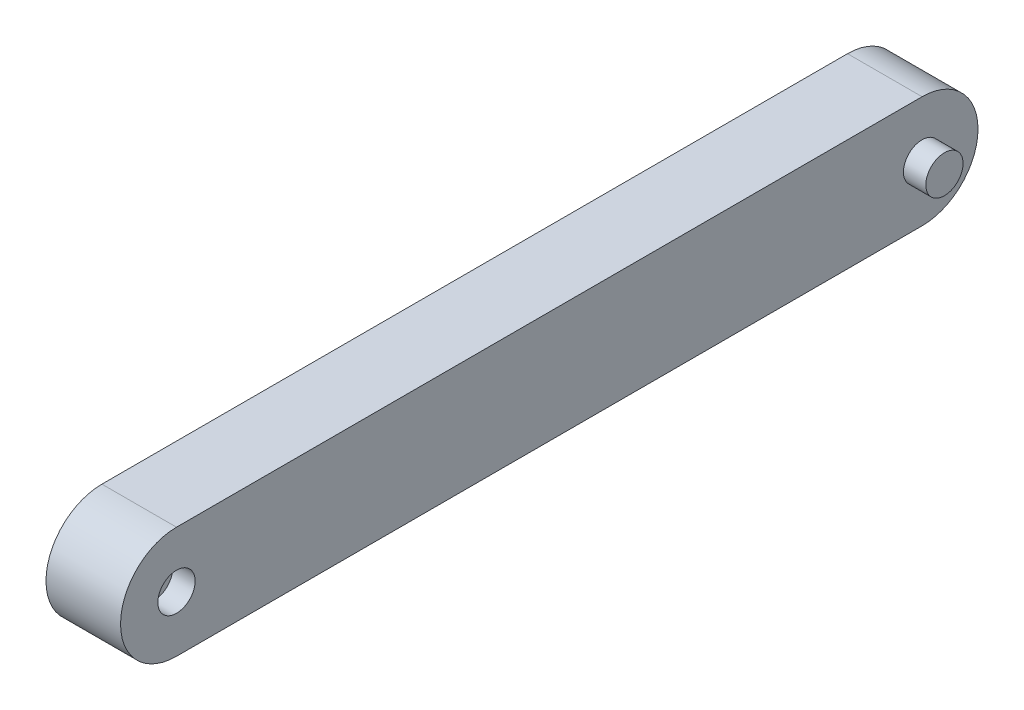
ISO-10303-21;
HEADER;
FILE_DESCRIPTION(('STEP AP214'),'2;1');
FILE_NAME('part.step','',(''),(''),'','','');
FILE_SCHEMA(('AUTOMOTIVE_DESIGN { 1 0 10303 214 1 1 1 1 }'));
ENDSEC;
DATA;
#1=APPLICATION_CONTEXT('core data for automotive mechanical design processes');
#2=APPLICATION_PROTOCOL_DEFINITION('international standard','automotive_design',2000,#1);
#3=PRODUCT_CONTEXT('',#1,'mechanical');
#4=PRODUCT('Part','Part','',(#3));
#5=PRODUCT_RELATED_PRODUCT_CATEGORY('part','',(#4));
#6=PRODUCT_DEFINITION_FORMATION('','',#4);
#7=PRODUCT_DEFINITION_CONTEXT('part definition',#1,'design');
#8=PRODUCT_DEFINITION('design','',#6,#7);
#9=PRODUCT_DEFINITION_SHAPE('','',#8);
#10=(LENGTH_UNIT() NAMED_UNIT(*) SI_UNIT(.MILLI.,.METRE.));
#11=(NAMED_UNIT(*) PLANE_ANGLE_UNIT() SI_UNIT($,.RADIAN.));
#12=(NAMED_UNIT(*) SI_UNIT($,.STERADIAN.) SOLID_ANGLE_UNIT());
#13=UNCERTAINTY_MEASURE_WITH_UNIT(LENGTH_MEASURE(1.E-05),#10,'distance_accuracy_value','');
#14=(GEOMETRIC_REPRESENTATION_CONTEXT(3) GLOBAL_UNCERTAINTY_ASSIGNED_CONTEXT((#13)) GLOBAL_UNIT_ASSIGNED_CONTEXT((#10,
#11,#12)) REPRESENTATION_CONTEXT('',''));
#15=CARTESIAN_POINT('',(0.,0.,0.));
#16=DIRECTION('',(0.,0.,1.));
#17=DIRECTION('',(1.,0.,0.));
#18=AXIS2_PLACEMENT_3D('',#15,#16,#17);
#19=CARTESIAN_POINT('',(20.,-1.92908528670217E-13,100.));
#20=DIRECTION('',(-1.,0.,0.));
#21=DIRECTION('',(0.,0.,1.));
#22=AXIS2_PLACEMENT_3D('',#19,#20,#21);
#23=CYLINDRICAL_SURFACE('',#22,15.);
#24=CARTESIAN_POINT('',(0.,-1.92908528670217E-13,100.));
#25=DIRECTION('',(1.,0.,0.));
#26=DIRECTION('',(0.,0.,-1.));
#27=AXIS2_PLACEMENT_3D('',#24,#25,#26);
#28=CIRCLE('',#27,15.);
#29=CARTESIAN_POINT('',(0.,15.,100.));
#30=VERTEX_POINT('',#29);
#31=CARTESIAN_POINT('',(0.,-15.,100.));
#32=VERTEX_POINT('',#31);
#33=EDGE_CURVE('E111',#30,#32,#28,.T.);
#34=ORIENTED_EDGE('',*,*,#33,.T.);
#35=DIRECTION('',(-1.,0.,0.));
#36=VECTOR('',#35,1.);
#37=CARTESIAN_POINT('',(20.,-15.,100.));
#38=LINE('',#37,#36);
#39=CARTESIAN_POINT('',(20.,-15.,100.));
#40=VERTEX_POINT('',#39);
#41=EDGE_CURVE('E11',#40,#32,#38,.T.);
#42=ORIENTED_EDGE('',*,*,#41,.F.);
#43=CARTESIAN_POINT('',(20.,-1.92908528670217E-13,100.));
#44=DIRECTION('',(1.,0.,0.));
#45=DIRECTION('',(0.,0.,-1.));
#46=AXIS2_PLACEMENT_3D('',#43,#44,#45);
#47=CIRCLE('',#46,15.);
#48=CARTESIAN_POINT('',(20.,15.,100.));
#49=VERTEX_POINT('',#48);
#50=EDGE_CURVE('E95',#49,#40,#47,.T.);
#51=ORIENTED_EDGE('',*,*,#50,.F.);
#52=DIRECTION('',(-1.,0.,0.));
#53=VECTOR('',#52,1.);
#54=CARTESIAN_POINT('',(20.,15.,100.));
#55=LINE('',#54,#53);
#56=EDGE_CURVE('E107',#49,#30,#55,.T.);
#57=ORIENTED_EDGE('',*,*,#56,.T.);
#58=EDGE_LOOP('',(#34,#42,#51,#57));
#59=FACE_BOUND('',#58,.T.);
#60=ADVANCED_FACE('F43',(#59),#23,.T.);
#61=CARTESIAN_POINT('',(20.,-15.,-100.));
#62=DIRECTION('',(0.,1.,0.));
#63=DIRECTION('',(0.,0.,1.));
#64=AXIS2_PLACEMENT_3D('',#61,#62,#63);
#65=PLANE('',#64);
#66=DIRECTION('',(0.,0.,-1.));
#67=VECTOR('',#66,1.);
#68=CARTESIAN_POINT('',(0.,-15.,-100.));
#69=LINE('',#68,#67);
#70=CARTESIAN_POINT('',(0.,-15.,-100.));
#71=VERTEX_POINT('',#70);
#72=EDGE_CURVE('E100',#32,#71,#69,.T.);
#73=ORIENTED_EDGE('',*,*,#72,.T.);
#74=DIRECTION('',(-1.,0.,0.));
#75=VECTOR('',#74,1.);
#76=CARTESIAN_POINT('',(20.,-15.,-100.));
#77=LINE('',#76,#75);
#78=CARTESIAN_POINT('',(20.,-15.,-100.));
#79=VERTEX_POINT('',#78);
#80=EDGE_CURVE('E52',#79,#71,#77,.T.);
#81=ORIENTED_EDGE('',*,*,#80,.F.);
#82=DIRECTION('',(0.,0.,-1.));
#83=VECTOR('',#82,1.);
#84=CARTESIAN_POINT('',(20.,-15.,-100.));
#85=LINE('',#84,#83);
#86=EDGE_CURVE('E90',#40,#79,#85,.T.);
#87=ORIENTED_EDGE('',*,*,#86,.F.);
#88=ORIENTED_EDGE('',*,*,#41,.T.);
#89=EDGE_LOOP('',(#73,#81,#87,#88));
#90=FACE_BOUND('',#89,.T.);
#91=ADVANCED_FACE('F99',(#90),#65,.F.);
#92=CARTESIAN_POINT('',(20.,0.,-100.000000049961));
#93=DIRECTION('',(-1.,0.,0.));
#94=DIRECTION('',(0.,0.,1.));
#95=AXIS2_PLACEMENT_3D('',#92,#93,#94);
#96=CYLINDRICAL_SURFACE('',#95,15.);
#97=CARTESIAN_POINT('',(0.,0.,-100.000000049961));
#98=DIRECTION('',(1.,0.,0.));
#99=DIRECTION('',(0.,0.,1.));
#100=AXIS2_PLACEMENT_3D('',#97,#98,#99);
#101=CIRCLE('',#100,15.);
#102=CARTESIAN_POINT('',(0.,15.,-100.000000099922));
#103=VERTEX_POINT('',#102);
#104=EDGE_CURVE('E77',#71,#103,#101,.T.);
#105=ORIENTED_EDGE('',*,*,#104,.T.);
#106=DIRECTION('',(-1.,0.,0.));
#107=VECTOR('',#106,1.);
#108=CARTESIAN_POINT('',(20.,15.,-100.000000099922));
#109=LINE('',#108,#107);
#110=CARTESIAN_POINT('',(20.,15.,-100.000000099922));
#111=VERTEX_POINT('',#110);
#112=EDGE_CURVE('E102',#111,#103,#109,.T.);
#113=ORIENTED_EDGE('',*,*,#112,.F.);
#114=CARTESIAN_POINT('',(20.,0.,-100.000000049961));
#115=DIRECTION('',(1.,0.,0.));
#116=DIRECTION('',(0.,0.,1.));
#117=AXIS2_PLACEMENT_3D('',#114,#115,#116);
#118=CIRCLE('',#117,15.);
#119=EDGE_CURVE('E93',#79,#111,#118,.T.);
#120=ORIENTED_EDGE('',*,*,#119,.F.);
#121=ORIENTED_EDGE('',*,*,#80,.T.);
#122=EDGE_LOOP('',(#105,#113,#120,#121));
#123=FACE_BOUND('',#122,.T.);
#124=ADVANCED_FACE('F103',(#123),#96,.T.);
#125=CARTESIAN_POINT('',(20.,15.,-100.000000099922));
#126=DIRECTION('',(0.,-1.,0.));
#127=DIRECTION('',(0.,0.,-1.));
#128=AXIS2_PLACEMENT_3D('',#125,#126,#127);
#129=PLANE('',#128);
#130=DIRECTION('',(0.,0.,1.));
#131=VECTOR('',#130,1.);
#132=CARTESIAN_POINT('',(0.,15.,-100.000000099922));
#133=LINE('',#132,#131);
#134=EDGE_CURVE('E83',#103,#30,#133,.T.);
#135=ORIENTED_EDGE('',*,*,#134,.T.);
#136=ORIENTED_EDGE('',*,*,#56,.F.);
#137=DIRECTION('',(0.,0.,1.));
#138=VECTOR('',#137,1.);
#139=CARTESIAN_POINT('',(20.,15.,-100.000000099922));
#140=LINE('',#139,#138);
#141=EDGE_CURVE('E60',#111,#49,#140,.T.);
#142=ORIENTED_EDGE('',*,*,#141,.F.);
#143=ORIENTED_EDGE('',*,*,#112,.T.);
#144=EDGE_LOOP('',(#135,#136,#142,#143));
#145=FACE_BOUND('',#144,.T.);
#146=ADVANCED_FACE('F125',(#145),#129,.F.);
#147=CARTESIAN_POINT('',(20.,-1.92908528670217E-13,100.));
#148=DIRECTION('',(1.,0.,0.));
#149=DIRECTION('',(0.,0.,-1.));
#150=AXIS2_PLACEMENT_3D('',#147,#148,#149);
#151=PLANE('',#150);
#152=CARTESIAN_POINT('',(20.,-1.92908528670217E-13,100.));
#153=DIRECTION('',(1.,0.,0.));
#154=DIRECTION('',(0.,0.,-1.));
#155=AXIS2_PLACEMENT_3D('',#152,#153,#154);
#156=CIRCLE('',#155,5.);
#157=CARTESIAN_POINT('',(20.,-1.92908528670217E-13,95.));
#158=VERTEX_POINT('',#157);
#159=EDGE_CURVE('E140',#158,#158,#156,.T.);
#160=ORIENTED_EDGE('',*,*,#159,.F.);
#161=EDGE_LOOP('',(#160));
#162=FACE_BOUND('',#161,.T.);
#163=CARTESIAN_POINT('',(20.,0.,-100.000000049961));
#164=DIRECTION('',(1.,0.,0.));
#165=DIRECTION('',(0.,0.,-1.));
#166=AXIS2_PLACEMENT_3D('',#163,#164,#165);
#167=CIRCLE('',#166,5.);
#168=CARTESIAN_POINT('',(20.,0.,-105.000000049961));
#169=VERTEX_POINT('',#168);
#170=EDGE_CURVE('E132',#169,#169,#167,.T.);
#171=ORIENTED_EDGE('',*,*,#170,.F.);
#172=EDGE_LOOP('',(#171));
#173=FACE_BOUND('',#172,.T.);
#174=ORIENTED_EDGE('',*,*,#50,.T.);
#175=ORIENTED_EDGE('',*,*,#86,.T.);
#176=ORIENTED_EDGE('',*,*,#119,.T.);
#177=ORIENTED_EDGE('',*,*,#141,.T.);
#178=EDGE_LOOP('',(#174,#175,#176,#177));
#179=FACE_BOUND('',#178,.T.);
#180=ADVANCED_FACE('F91',(#162,#173,#179),#151,.T.);
#181=CARTESIAN_POINT('',(0.,-1.92908528670217E-13,100.));
#182=DIRECTION('',(1.,0.,0.));
#183=DIRECTION('',(0.,0.,-1.));
#184=AXIS2_PLACEMENT_3D('',#181,#182,#183);
#185=PLANE('',#184);
#186=CARTESIAN_POINT('',(0.,-1.92908528670217E-13,100.));
#187=DIRECTION('',(1.,0.,0.));
#188=DIRECTION('',(0.,0.,-1.));
#189=AXIS2_PLACEMENT_3D('',#186,#187,#188);
#190=CIRCLE('',#189,5.);
#191=CARTESIAN_POINT('',(0.,-1.92908528670217E-13,95.));
#192=VERTEX_POINT('',#191);
#193=EDGE_CURVE('E156',#192,#192,#190,.T.);
#194=ORIENTED_EDGE('',*,*,#193,.T.);
#195=EDGE_LOOP('',(#194));
#196=FACE_BOUND('',#195,.T.);
#197=CARTESIAN_POINT('',(0.,0.,-100.000000049961));
#198=DIRECTION('',(1.,0.,0.));
#199=DIRECTION('',(0.,0.,-1.));
#200=AXIS2_PLACEMENT_3D('',#197,#198,#199);
#201=CIRCLE('',#200,5.);
#202=CARTESIAN_POINT('',(0.,0.,-105.000000049961));
#203=VERTEX_POINT('',#202);
#204=EDGE_CURVE('E148',#203,#203,#201,.T.);
#205=ORIENTED_EDGE('',*,*,#204,.T.);
#206=EDGE_LOOP('',(#205));
#207=FACE_BOUND('',#206,.T.);
#208=ORIENTED_EDGE('',*,*,#33,.F.);
#209=ORIENTED_EDGE('',*,*,#134,.F.);
#210=ORIENTED_EDGE('',*,*,#104,.F.);
#211=ORIENTED_EDGE('',*,*,#72,.F.);
#212=EDGE_LOOP('',(#208,#209,#210,#211));
#213=FACE_BOUND('',#212,.T.);
#214=ADVANCED_FACE('F128',(#196,#207,#213),#185,.F.);
#215=CARTESIAN_POINT('',(26.,0.,-100.000000049961));
#216=DIRECTION('',(-1.,0.,0.));
#217=DIRECTION('',(0.,0.,1.));
#218=AXIS2_PLACEMENT_3D('',#215,#216,#217);
#219=CYLINDRICAL_SURFACE('',#218,5.);
#220=CARTESIAN_POINT('',(26.,0.,-100.000000049961));
#221=DIRECTION('',(1.,0.,0.));
#222=DIRECTION('',(0.,0.,-1.));
#223=AXIS2_PLACEMENT_3D('',#220,#221,#222);
#224=CIRCLE('',#223,5.);
#225=CARTESIAN_POINT('',(26.,0.,-105.000000049961));
#226=VERTEX_POINT('',#225);
#227=EDGE_CURVE('E115',#226,#226,#224,.T.);
#228=ORIENTED_EDGE('',*,*,#227,.F.);
#229=EDGE_LOOP('',(#228));
#230=FACE_BOUND('',#229,.T.);
#231=ORIENTED_EDGE('',*,*,#170,.T.);
#232=EDGE_LOOP('',(#231));
#233=FACE_BOUND('',#232,.T.);
#234=ADVANCED_FACE('F188',(#230,#233),#219,.T.);
#235=CARTESIAN_POINT('',(26.,0.,-100.000000049961));
#236=DIRECTION('',(1.,0.,0.));
#237=DIRECTION('',(0.,0.,-1.));
#238=AXIS2_PLACEMENT_3D('',#235,#236,#237);
#239=PLANE('',#238);
#240=ORIENTED_EDGE('',*,*,#227,.T.);
#241=EDGE_LOOP('',(#240));
#242=FACE_BOUND('',#241,.T.);
#243=ADVANCED_FACE('F195',(#242),#239,.T.);
#244=CARTESIAN_POINT('',(14.,-1.92908528670217E-13,100.));
#245=DIRECTION('',(1.,0.,0.));
#246=DIRECTION('',(0.,0.,-1.));
#247=AXIS2_PLACEMENT_3D('',#244,#245,#246);
#248=CYLINDRICAL_SURFACE('',#247,5.);
#249=CARTESIAN_POINT('',(14.,-1.92908528670217E-13,100.));
#250=DIRECTION('',(1.,0.,0.));
#251=DIRECTION('',(0.,0.,-1.));
#252=AXIS2_PLACEMENT_3D('',#249,#250,#251);
#253=CIRCLE('',#252,5.);
#254=CARTESIAN_POINT('',(14.,-1.92908528670217E-13,95.));
#255=VERTEX_POINT('',#254);
#256=EDGE_CURVE('E136',#255,#255,#253,.T.);
#257=ORIENTED_EDGE('',*,*,#256,.F.);
#258=EDGE_LOOP('',(#257));
#259=FACE_BOUND('',#258,.T.);
#260=ORIENTED_EDGE('',*,*,#159,.T.);
#261=EDGE_LOOP('',(#260));
#262=FACE_BOUND('',#261,.T.);
#263=ADVANCED_FACE('F199',(#259,#262),#248,.F.);
#264=CARTESIAN_POINT('',(14.,-1.92908528670217E-13,100.));
#265=DIRECTION('',(1.,0.,0.));
#266=DIRECTION('',(0.,0.,-1.));
#267=AXIS2_PLACEMENT_3D('',#264,#265,#266);
#268=PLANE('',#267);
#269=ORIENTED_EDGE('',*,*,#256,.T.);
#270=EDGE_LOOP('',(#269));
#271=FACE_BOUND('',#270,.T.);
#272=ADVANCED_FACE('F203',(#271),#268,.T.);
#273=CARTESIAN_POINT('',(-6.,0.,-100.000000049961));
#274=DIRECTION('',(1.,0.,0.));
#275=DIRECTION('',(0.,0.,-1.));
#276=AXIS2_PLACEMENT_3D('',#273,#274,#275);
#277=CYLINDRICAL_SURFACE('',#276,5.);
#278=CARTESIAN_POINT('',(-6.,0.,-100.000000049961));
#279=DIRECTION('',(1.,0.,0.));
#280=DIRECTION('',(0.,0.,-1.));
#281=AXIS2_PLACEMENT_3D('',#278,#279,#280);
#282=CIRCLE('',#281,5.);
#283=CARTESIAN_POINT('',(-6.,0.,-105.000000049961));
#284=VERTEX_POINT('',#283);
#285=EDGE_CURVE('E144',#284,#284,#282,.T.);
#286=ORIENTED_EDGE('',*,*,#285,.T.);
#287=EDGE_LOOP('',(#286));
#288=FACE_BOUND('',#287,.T.);
#289=ORIENTED_EDGE('',*,*,#204,.F.);
#290=EDGE_LOOP('',(#289));
#291=FACE_BOUND('',#290,.T.);
#292=ADVANCED_FACE('F207',(#288,#291),#277,.T.);
#293=CARTESIAN_POINT('',(-6.,0.,-100.000000049961));
#294=DIRECTION('',(-1.,0.,0.));
#295=DIRECTION('',(0.,0.,-1.));
#296=AXIS2_PLACEMENT_3D('',#293,#294,#295);
#297=PLANE('',#296);
#298=ORIENTED_EDGE('',*,*,#285,.F.);
#299=EDGE_LOOP('',(#298));
#300=FACE_BOUND('',#299,.T.);
#301=ADVANCED_FACE('F173',(#300),#297,.T.);
#302=CARTESIAN_POINT('',(6.,-1.92908528670217E-13,100.));
#303=DIRECTION('',(-1.,0.,0.));
#304=DIRECTION('',(0.,0.,1.));
#305=AXIS2_PLACEMENT_3D('',#302,#303,#304);
#306=CYLINDRICAL_SURFACE('',#305,5.);
#307=CARTESIAN_POINT('',(6.,-1.92908528670217E-13,100.));
#308=DIRECTION('',(1.,0.,0.));
#309=DIRECTION('',(0.,0.,-1.));
#310=AXIS2_PLACEMENT_3D('',#307,#308,#309);
#311=CIRCLE('',#310,5.);
#312=CARTESIAN_POINT('',(6.,-1.92908528670217E-13,95.));
#313=VERTEX_POINT('',#312);
#314=EDGE_CURVE('E152',#313,#313,#311,.T.);
#315=ORIENTED_EDGE('',*,*,#314,.T.);
#316=EDGE_LOOP('',(#315));
#317=FACE_BOUND('',#316,.T.);
#318=ORIENTED_EDGE('',*,*,#193,.F.);
#319=EDGE_LOOP('',(#318));
#320=FACE_BOUND('',#319,.T.);
#321=ADVANCED_FACE('F164',(#317,#320),#306,.F.);
#322=CARTESIAN_POINT('',(6.,-1.92908528670217E-13,100.));
#323=DIRECTION('',(-1.,0.,0.));
#324=DIRECTION('',(0.,0.,-1.));
#325=AXIS2_PLACEMENT_3D('',#322,#323,#324);
#326=PLANE('',#325);
#327=ORIENTED_EDGE('',*,*,#314,.F.);
#328=EDGE_LOOP('',(#327));
#329=FACE_BOUND('',#328,.T.);
#330=ADVANCED_FACE('F167',(#329),#326,.T.);
#331=CLOSED_SHELL('',(#60,#91,#124,#146,#180,#214,#234,#243,#263,#272,#292,#301,#321,#330));
#332=MANIFOLD_SOLID_BREP('B2',#331);
#333=ADVANCED_BREP_SHAPE_REPRESENTATION('',(#18,#332),#14);
#334=SHAPE_DEFINITION_REPRESENTATION(#9,#333);
ENDSEC;
END-ISO-10303-21;
